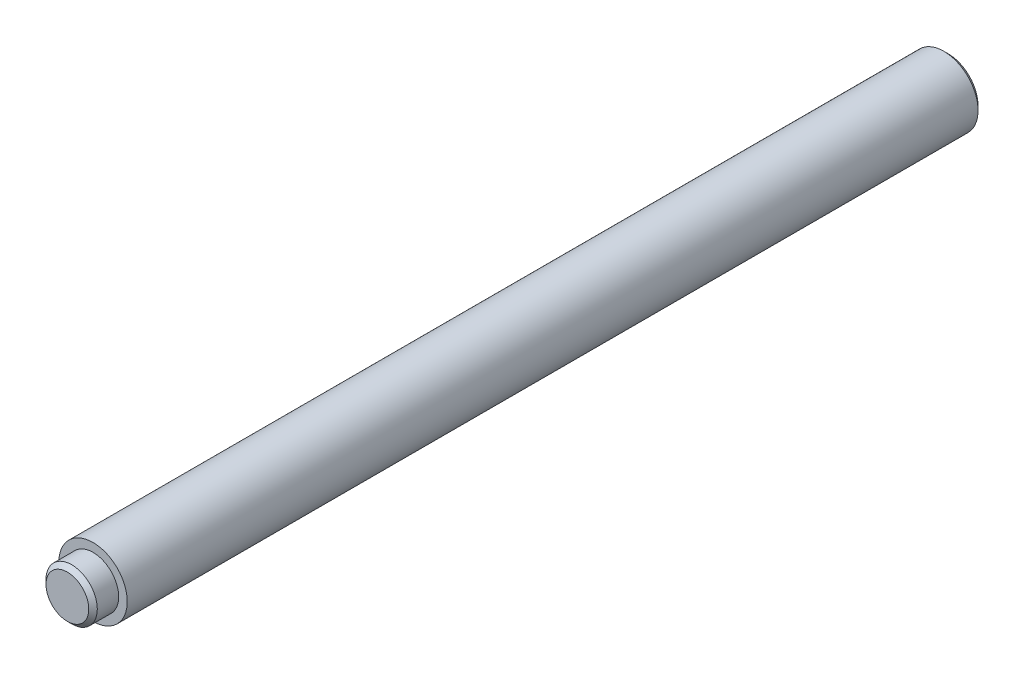
ISO-10303-21;
HEADER;
FILE_DESCRIPTION(('STEP AP214'),'2;1');
FILE_NAME('part.step','',(''),(''),'','','');
FILE_SCHEMA(('AUTOMOTIVE_DESIGN { 1 0 10303 214 1 1 1 1 }'));
ENDSEC;
DATA;
#1=APPLICATION_CONTEXT('core data for automotive mechanical design processes');
#2=APPLICATION_PROTOCOL_DEFINITION('international standard','automotive_design',2000,#1);
#3=PRODUCT_CONTEXT('',#1,'mechanical');
#4=PRODUCT('Part','Part','',(#3));
#5=PRODUCT_RELATED_PRODUCT_CATEGORY('part','',(#4));
#6=PRODUCT_DEFINITION_FORMATION('','',#4);
#7=PRODUCT_DEFINITION_CONTEXT('part definition',#1,'design');
#8=PRODUCT_DEFINITION('design','',#6,#7);
#9=PRODUCT_DEFINITION_SHAPE('','',#8);
#10=(LENGTH_UNIT() NAMED_UNIT(*) SI_UNIT(.MILLI.,.METRE.));
#11=(NAMED_UNIT(*) PLANE_ANGLE_UNIT() SI_UNIT($,.RADIAN.));
#12=(NAMED_UNIT(*) SI_UNIT($,.STERADIAN.) SOLID_ANGLE_UNIT());
#13=UNCERTAINTY_MEASURE_WITH_UNIT(LENGTH_MEASURE(1.E-05),#10,'distance_accuracy_value','');
#14=(GEOMETRIC_REPRESENTATION_CONTEXT(3) GLOBAL_UNCERTAINTY_ASSIGNED_CONTEXT((#13)) GLOBAL_UNIT_ASSIGNED_CONTEXT((#10,
#11,#12)) REPRESENTATION_CONTEXT('',''));
#15=CARTESIAN_POINT('',(0.,0.,0.));
#16=DIRECTION('',(0.,0.,1.));
#17=DIRECTION('',(1.,0.,0.));
#18=AXIS2_PLACEMENT_3D('',#15,#16,#17);
#19=CARTESIAN_POINT('',(0.,0.,-100.));
#20=DIRECTION('',(0.,0.,-1.));
#21=DIRECTION('',(-1.,0.,0.));
#22=AXIS2_PLACEMENT_3D('',#19,#20,#21);
#23=PLANE('',#22);
#24=CARTESIAN_POINT('',(0.,0.,-100.));
#25=DIRECTION('',(0.,0.,-1.));
#26=DIRECTION('',(-1.,0.,0.));
#27=AXIS2_PLACEMENT_3D('',#24,#25,#26);
#28=CIRCLE('',#27,3.5);
#29=CARTESIAN_POINT('',(-3.5,0.,-100.));
#30=VERTEX_POINT('',#29);
#31=EDGE_CURVE('E46',#30,#30,#28,.T.);
#32=ORIENTED_EDGE('',*,*,#31,.T.);
#33=EDGE_LOOP('',(#32));
#34=FACE_BOUND('',#33,.T.);
#35=ADVANCED_FACE('F31',(#34),#23,.T.);
#36=CARTESIAN_POINT('',(0.,3.,3.));
#37=DIRECTION('',(0.,0.,1.));
#38=DIRECTION('',(1.,0.,0.));
#39=AXIS2_PLACEMENT_3D('',#36,#37,#38);
#40=PLANE('',#39);
#41=CARTESIAN_POINT('',(0.,0.,3.));
#42=DIRECTION('',(0.,0.,1.));
#43=DIRECTION('',(1.,0.,0.));
#44=AXIS2_PLACEMENT_3D('',#41,#42,#43);
#45=CIRCLE('',#44,2.5);
#46=CARTESIAN_POINT('',(2.5,0.,3.));
#47=VERTEX_POINT('',#46);
#48=EDGE_CURVE('E10',#47,#47,#45,.T.);
#49=ORIENTED_EDGE('',*,*,#48,.T.);
#50=EDGE_LOOP('',(#49));
#51=FACE_BOUND('',#50,.T.);
#52=ADVANCED_FACE('F72',(#51),#40,.T.);
#53=CARTESIAN_POINT('',(0.,0.,3.));
#54=DIRECTION('',(0.,0.,-1.));
#55=DIRECTION('',(-1.,0.,0.));
#56=AXIS2_PLACEMENT_3D('',#53,#54,#55);
#57=CYLINDRICAL_SURFACE('',#56,3.);
#58=CARTESIAN_POINT('',(0.,0.,2.50000000000001));
#59=DIRECTION('',(0.,0.,1.));
#60=DIRECTION('',(1.,0.,0.));
#61=AXIS2_PLACEMENT_3D('',#58,#59,#60);
#62=CIRCLE('',#61,3.);
#63=CARTESIAN_POINT('',(3.,0.,2.50000000000001));
#64=VERTEX_POINT('',#63);
#65=EDGE_CURVE('E38',#64,#64,#62,.F.);
#66=ORIENTED_EDGE('',*,*,#65,.T.);
#67=EDGE_LOOP('',(#66));
#68=FACE_BOUND('',#67,.T.);
#69=CARTESIAN_POINT('',(0.,0.,0.));
#70=DIRECTION('',(0.,0.,-1.));
#71=DIRECTION('',(-1.,0.,0.));
#72=AXIS2_PLACEMENT_3D('',#69,#70,#71);
#73=CIRCLE('',#72,3.);
#74=CARTESIAN_POINT('',(-3.,0.,0.));
#75=VERTEX_POINT('',#74);
#76=EDGE_CURVE('E51',#75,#75,#73,.T.);
#77=ORIENTED_EDGE('',*,*,#76,.F.);
#78=EDGE_LOOP('',(#77));
#79=FACE_BOUND('',#78,.T.);
#80=ADVANCED_FACE('F62',(#68,#79),#57,.T.);
#81=CARTESIAN_POINT('',(0.,3.,0.));
#82=DIRECTION('',(0.,0.,1.));
#83=DIRECTION('',(1.,0.,0.));
#84=AXIS2_PLACEMENT_3D('',#81,#82,#83);
#85=PLANE('',#84);
#86=ORIENTED_EDGE('',*,*,#76,.T.);
#87=EDGE_LOOP('',(#86));
#88=FACE_BOUND('',#87,.T.);
#89=CARTESIAN_POINT('',(0.,0.,0.));
#90=DIRECTION('',(0.,0.,-1.));
#91=DIRECTION('',(-1.,0.,0.));
#92=AXIS2_PLACEMENT_3D('',#89,#90,#91);
#93=CIRCLE('',#92,4.);
#94=CARTESIAN_POINT('',(-4.,0.,0.));
#95=VERTEX_POINT('',#94);
#96=EDGE_CURVE('E54',#95,#95,#93,.T.);
#97=ORIENTED_EDGE('',*,*,#96,.F.);
#98=EDGE_LOOP('',(#97));
#99=FACE_BOUND('',#98,.T.);
#100=ADVANCED_FACE('F60',(#88,#99),#85,.T.);
#101=CARTESIAN_POINT('',(0.,0.,3.));
#102=DIRECTION('',(0.,0.,-1.));
#103=DIRECTION('',(-1.,0.,0.));
#104=AXIS2_PLACEMENT_3D('',#101,#102,#103);
#105=CYLINDRICAL_SURFACE('',#104,4.);
#106=CARTESIAN_POINT('',(0.,0.,-99.5));
#107=DIRECTION('',(0.,0.,-1.));
#108=DIRECTION('',(-1.,0.,0.));
#109=AXIS2_PLACEMENT_3D('',#106,#107,#108);
#110=CIRCLE('',#109,4.);
#111=CARTESIAN_POINT('',(-4.,0.,-99.5));
#112=VERTEX_POINT('',#111);
#113=EDGE_CURVE('E42',#112,#112,#110,.F.);
#114=ORIENTED_EDGE('',*,*,#113,.T.);
#115=EDGE_LOOP('',(#114));
#116=FACE_BOUND('',#115,.T.);
#117=ORIENTED_EDGE('',*,*,#96,.T.);
#118=EDGE_LOOP('',(#117));
#119=FACE_BOUND('',#118,.T.);
#120=ADVANCED_FACE('F58',(#116,#119),#105,.T.);
#121=CARTESIAN_POINT('',(0.,0.,-100.));
#122=DIRECTION('',(0.,0.,1.));
#123=DIRECTION('',(1.,0.,0.));
#124=AXIS2_PLACEMENT_3D('',#121,#122,#123);
#125=CONICAL_SURFACE('',#124,3.5,0.785398163397445);
#126=ORIENTED_EDGE('',*,*,#113,.F.);
#127=EDGE_LOOP('',(#126));
#128=FACE_BOUND('',#127,.T.);
#129=ORIENTED_EDGE('',*,*,#31,.F.);
#130=EDGE_LOOP('',(#129));
#131=FACE_BOUND('',#130,.T.);
#132=ADVANCED_FACE('F69',(#128,#131),#125,.T.);
#133=CARTESIAN_POINT('',(0.,0.,2.50000000000001));
#134=DIRECTION('',(0.,0.,-1.));
#135=DIRECTION('',(-1.,0.,0.));
#136=AXIS2_PLACEMENT_3D('',#133,#134,#135);
#137=CONICAL_SURFACE('',#136,3.,0.785398163397459);
#138=ORIENTED_EDGE('',*,*,#48,.F.);
#139=EDGE_LOOP('',(#138));
#140=FACE_BOUND('',#139,.T.);
#141=ORIENTED_EDGE('',*,*,#65,.F.);
#142=EDGE_LOOP('',(#141));
#143=FACE_BOUND('',#142,.T.);
#144=ADVANCED_FACE('F33',(#140,#143),#137,.T.);
#145=CLOSED_SHELL('',(#35,#52,#80,#100,#120,#132,#144));
#146=MANIFOLD_SOLID_BREP('B2',#145);
#147=ADVANCED_BREP_SHAPE_REPRESENTATION('',(#18,#146),#14);
#148=SHAPE_DEFINITION_REPRESENTATION(#9,#147);
ENDSEC;
END-ISO-10303-21;
